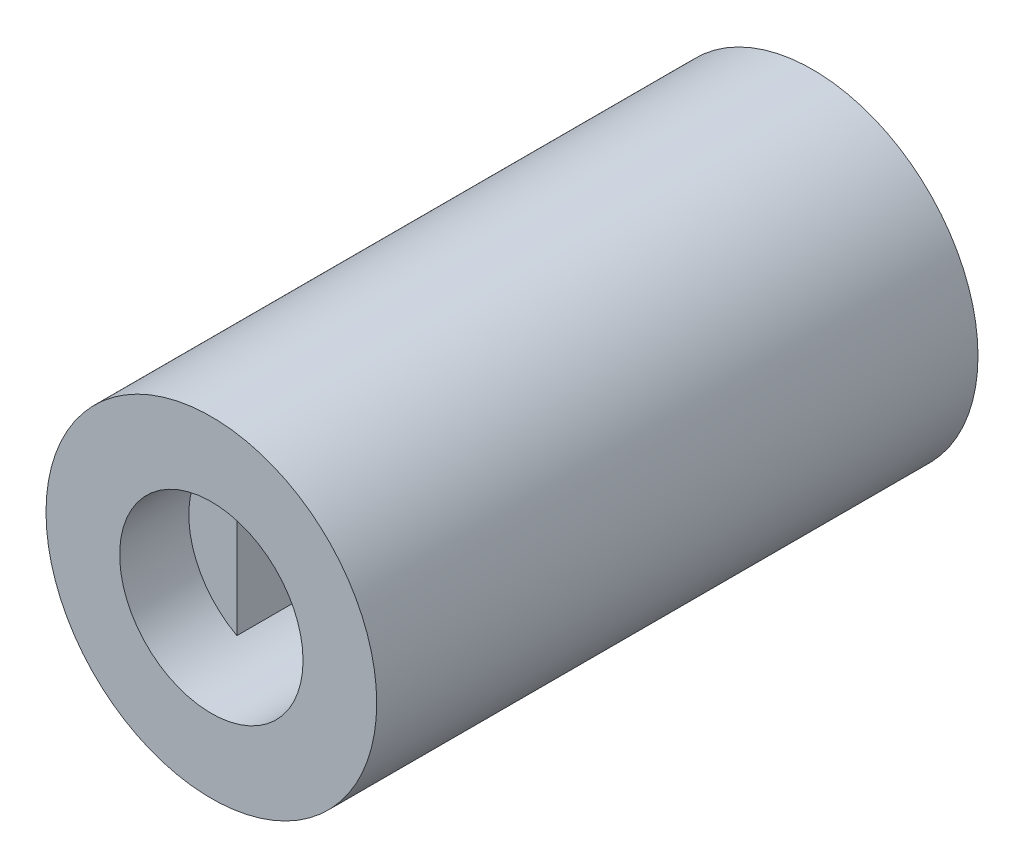
ISO-10303-21;
HEADER;
FILE_DESCRIPTION(('STEP AP214'),'2;1');
FILE_NAME('part.step','',(''),(''),'','','');
FILE_SCHEMA(('AUTOMOTIVE_DESIGN { 1 0 10303 214 1 1 1 1 }'));
ENDSEC;
DATA;
#1=APPLICATION_CONTEXT('core data for automotive mechanical design processes');
#2=APPLICATION_PROTOCOL_DEFINITION('international standard','automotive_design',2000,#1);
#3=PRODUCT_CONTEXT('',#1,'mechanical');
#4=PRODUCT('Part','Part','',(#3));
#5=PRODUCT_RELATED_PRODUCT_CATEGORY('part','',(#4));
#6=PRODUCT_DEFINITION_FORMATION('','',#4);
#7=PRODUCT_DEFINITION_CONTEXT('part definition',#1,'design');
#8=PRODUCT_DEFINITION('design','',#6,#7);
#9=PRODUCT_DEFINITION_SHAPE('','',#8);
#10=(LENGTH_UNIT() NAMED_UNIT(*) SI_UNIT(.MILLI.,.METRE.));
#11=(NAMED_UNIT(*) PLANE_ANGLE_UNIT() SI_UNIT($,.RADIAN.));
#12=(NAMED_UNIT(*) SI_UNIT($,.STERADIAN.) SOLID_ANGLE_UNIT());
#13=UNCERTAINTY_MEASURE_WITH_UNIT(LENGTH_MEASURE(1.E-05),#10,'distance_accuracy_value','');
#14=(GEOMETRIC_REPRESENTATION_CONTEXT(3) GLOBAL_UNCERTAINTY_ASSIGNED_CONTEXT((#13)) GLOBAL_UNIT_ASSIGNED_CONTEXT((#10,
#11,#12)) REPRESENTATION_CONTEXT('',''));
#15=CARTESIAN_POINT('',(0.,0.,0.));
#16=DIRECTION('',(0.,0.,1.));
#17=DIRECTION('',(1.,0.,0.));
#18=AXIS2_PLACEMENT_3D('',#15,#16,#17);
#19=CARTESIAN_POINT('',(-1.45,0.,8.));
#20=DIRECTION('',(1.,0.,0.));
#21=DIRECTION('',(0.,1.,0.));
#22=AXIS2_PLACEMENT_3D('',#19,#20,#21);
#23=PLANE('',#22);
#24=DIRECTION('',(0.,0.,1.));
#25=VECTOR('',#24,1.);
#26=CARTESIAN_POINT('',(-1.45,2.68328157299975,8.));
#27=LINE('',#26,#25);
#28=CARTESIAN_POINT('',(-1.45,2.68328157299975,8.));
#29=VERTEX_POINT('',#28);
#30=CARTESIAN_POINT('',(-1.45,2.68328157299975,17.7));
#31=VERTEX_POINT('',#30);
#32=EDGE_CURVE('E96',#29,#31,#27,.T.);
#33=ORIENTED_EDGE('',*,*,#32,.T.);
#34=DIRECTION('',(0.,-1.,0.));
#35=VECTOR('',#34,1.);
#36=CARTESIAN_POINT('',(-1.45,0.,17.7));
#37=LINE('',#36,#35);
#38=CARTESIAN_POINT('',(-1.45,-2.68328157299975,17.7));
#39=VERTEX_POINT('',#38);
#40=EDGE_CURVE('E86',#31,#39,#37,.T.);
#41=ORIENTED_EDGE('',*,*,#40,.T.);
#42=DIRECTION('',(0.,0.,1.));
#43=VECTOR('',#42,1.);
#44=CARTESIAN_POINT('',(-1.45,-2.68328157299975,8.));
#45=LINE('',#44,#43);
#46=CARTESIAN_POINT('',(-1.45,-2.68328157299975,8.));
#47=VERTEX_POINT('',#46);
#48=EDGE_CURVE('E98',#47,#39,#45,.T.);
#49=ORIENTED_EDGE('',*,*,#48,.F.);
#50=DIRECTION('',(0.,1.,0.));
#51=VECTOR('',#50,1.);
#52=CARTESIAN_POINT('',(-1.45,0.,8.));
#53=LINE('',#52,#51);
#54=EDGE_CURVE('E101',#47,#29,#53,.T.);
#55=ORIENTED_EDGE('',*,*,#54,.T.);
#56=EDGE_LOOP('',(#33,#41,#49,#55));
#57=FACE_BOUND('',#56,.T.);
#58=ADVANCED_FACE('F36',(#57),#23,.T.);
#59=CARTESIAN_POINT('',(0.,0.,0.));
#60=DIRECTION('',(0.,0.,1.));
#61=DIRECTION('',(1.,0.,0.));
#62=AXIS2_PLACEMENT_3D('',#59,#60,#61);
#63=PLANE('',#62);
#64=CARTESIAN_POINT('',(0.,0.,0.));
#65=DIRECTION('',(0.,0.,1.));
#66=DIRECTION('',(1.,0.,0.));
#67=AXIS2_PLACEMENT_3D('',#64,#65,#66);
#68=CIRCLE('',#67,5.5);
#69=CARTESIAN_POINT('',(5.5,0.,0.));
#70=VERTEX_POINT('',#69);
#71=EDGE_CURVE('E40',#70,#70,#68,.T.);
#72=ORIENTED_EDGE('',*,*,#71,.F.);
#73=EDGE_LOOP('',(#72));
#74=FACE_BOUND('',#73,.T.);
#75=DIRECTION('',(0.,-1.,0.));
#76=VECTOR('',#75,1.);
#77=CARTESIAN_POINT('',(-2.3,0.,0.));
#78=LINE('',#77,#76);
#79=CARTESIAN_POINT('',(-2.3,2.07846096908265,0.));
#80=VERTEX_POINT('',#79);
#81=CARTESIAN_POINT('',(-2.3,-2.07846096908265,0.));
#82=VERTEX_POINT('',#81);
#83=EDGE_CURVE('E58',#80,#82,#78,.T.);
#84=ORIENTED_EDGE('',*,*,#83,.T.);
#85=CARTESIAN_POINT('',(0.,0.,0.));
#86=DIRECTION('',(0.,0.,-1.));
#87=DIRECTION('',(-1.,0.,0.));
#88=AXIS2_PLACEMENT_3D('',#85,#86,#87);
#89=CIRCLE('',#88,3.1);
#90=CARTESIAN_POINT('',(2.3,-2.07846096908265,0.));
#91=VERTEX_POINT('',#90);
#92=EDGE_CURVE('E124',#91,#82,#89,.T.);
#93=ORIENTED_EDGE('',*,*,#92,.F.);
#94=DIRECTION('',(0.,-1.,0.));
#95=VECTOR('',#94,1.);
#96=CARTESIAN_POINT('',(2.3,0.,0.));
#97=LINE('',#96,#95);
#98=CARTESIAN_POINT('',(2.3,2.07846096908265,0.));
#99=VERTEX_POINT('',#98);
#100=EDGE_CURVE('E121',#99,#91,#97,.T.);
#101=ORIENTED_EDGE('',*,*,#100,.F.);
#102=EDGE_CURVE('E125',#80,#99,#89,.T.);
#103=ORIENTED_EDGE('',*,*,#102,.F.);
#104=EDGE_LOOP('',(#84,#93,#101,#103));
#105=FACE_BOUND('',#104,.T.);
#106=ADVANCED_FACE('F147',(#74,#105),#63,.F.);
#107=CARTESIAN_POINT('',(0.,0.,20.));
#108=DIRECTION('',(0.,0.,1.));
#109=DIRECTION('',(1.,0.,0.));
#110=AXIS2_PLACEMENT_3D('',#107,#108,#109);
#111=PLANE('',#110);
#112=CARTESIAN_POINT('',(0.,0.,20.));
#113=DIRECTION('',(0.,0.,1.));
#114=DIRECTION('',(1.,0.,0.));
#115=AXIS2_PLACEMENT_3D('',#112,#113,#114);
#116=CIRCLE('',#115,3.05);
#117=CARTESIAN_POINT('',(3.05,0.,20.));
#118=VERTEX_POINT('',#117);
#119=EDGE_CURVE('E107',#118,#118,#116,.T.);
#120=ORIENTED_EDGE('',*,*,#119,.F.);
#121=EDGE_LOOP('',(#120));
#122=FACE_BOUND('',#121,.T.);
#123=CARTESIAN_POINT('',(0.,0.,20.));
#124=DIRECTION('',(0.,0.,1.));
#125=DIRECTION('',(1.,0.,0.));
#126=AXIS2_PLACEMENT_3D('',#123,#124,#125);
#127=CIRCLE('',#126,5.5);
#128=CARTESIAN_POINT('',(5.5,0.,20.));
#129=VERTEX_POINT('',#128);
#130=EDGE_CURVE('E12',#129,#129,#127,.T.);
#131=ORIENTED_EDGE('',*,*,#130,.T.);
#132=EDGE_LOOP('',(#131));
#133=FACE_BOUND('',#132,.T.);
#134=ADVANCED_FACE('F170',(#122,#133),#111,.T.);
#135=CARTESIAN_POINT('',(0.,0.,20.));
#136=DIRECTION('',(0.,0.,-1.));
#137=DIRECTION('',(-1.,0.,0.));
#138=AXIS2_PLACEMENT_3D('',#135,#136,#137);
#139=CYLINDRICAL_SURFACE('',#138,5.5);
#140=ORIENTED_EDGE('',*,*,#130,.F.);
#141=EDGE_LOOP('',(#140));
#142=FACE_BOUND('',#141,.T.);
#143=ORIENTED_EDGE('',*,*,#71,.T.);
#144=EDGE_LOOP('',(#143));
#145=FACE_BOUND('',#144,.T.);
#146=ADVANCED_FACE('F38',(#142,#145),#139,.T.);
#147=CARTESIAN_POINT('',(0.,0.,8.));
#148=DIRECTION('',(0.,0.,1.));
#149=DIRECTION('',(1.,0.,0.));
#150=AXIS2_PLACEMENT_3D('',#147,#148,#149);
#151=CYLINDRICAL_SURFACE('',#150,3.05);
#152=ORIENTED_EDGE('',*,*,#119,.T.);
#153=EDGE_LOOP('',(#152));
#154=FACE_BOUND('',#153,.T.);
#155=CARTESIAN_POINT('',(0.,0.,17.7));
#156=DIRECTION('',(0.,0.,1.));
#157=DIRECTION('',(1.,0.,0.));
#158=AXIS2_PLACEMENT_3D('',#155,#156,#157);
#159=CIRCLE('',#158,3.05);
#160=EDGE_CURVE('E50',#31,#39,#159,.T.);
#161=ORIENTED_EDGE('',*,*,#160,.F.);
#162=ORIENTED_EDGE('',*,*,#32,.F.);
#163=CARTESIAN_POINT('',(0.,0.,8.));
#164=DIRECTION('',(0.,0.,1.));
#165=DIRECTION('',(1.,0.,0.));
#166=AXIS2_PLACEMENT_3D('',#163,#164,#165);
#167=CIRCLE('',#166,3.05);
#168=EDGE_CURVE('E104',#47,#29,#167,.T.);
#169=ORIENTED_EDGE('',*,*,#168,.F.);
#170=ORIENTED_EDGE('',*,*,#48,.T.);
#171=EDGE_LOOP('',(#161,#162,#169,#170));
#172=FACE_BOUND('',#171,.T.);
#173=ADVANCED_FACE('F94',(#154,#172),#151,.F.);
#174=CARTESIAN_POINT('',(0.,0.,8.));
#175=DIRECTION('',(0.,0.,1.));
#176=DIRECTION('',(1.,0.,0.));
#177=AXIS2_PLACEMENT_3D('',#174,#175,#176);
#178=PLANE('',#177);
#179=ORIENTED_EDGE('',*,*,#54,.F.);
#180=ORIENTED_EDGE('',*,*,#168,.T.);
#181=EDGE_LOOP('',(#179,#180));
#182=FACE_BOUND('',#181,.T.);
#183=ADVANCED_FACE('F188',(#182),#178,.T.);
#184=CARTESIAN_POINT('',(-2.3,0.,7.8));
#185=DIRECTION('',(1.,0.,0.));
#186=DIRECTION('',(0.,0.,-1.));
#187=AXIS2_PLACEMENT_3D('',#184,#185,#186);
#188=PLANE('',#187);
#189=ORIENTED_EDGE('',*,*,#83,.F.);
#190=DIRECTION('',(0.,0.,-1.));
#191=VECTOR('',#190,1.);
#192=CARTESIAN_POINT('',(-2.3,2.07846096908265,7.8));
#193=LINE('',#192,#191);
#194=CARTESIAN_POINT('',(-2.3,2.07846096908265,7.8));
#195=VERTEX_POINT('',#194);
#196=EDGE_CURVE('E113',#195,#80,#193,.T.);
#197=ORIENTED_EDGE('',*,*,#196,.F.);
#198=DIRECTION('',(0.,-1.,0.));
#199=VECTOR('',#198,1.);
#200=CARTESIAN_POINT('',(-2.3,0.,7.8));
#201=LINE('',#200,#199);
#202=CARTESIAN_POINT('',(-2.3,-2.07846096908265,7.8));
#203=VERTEX_POINT('',#202);
#204=EDGE_CURVE('E135',#195,#203,#201,.T.);
#205=ORIENTED_EDGE('',*,*,#204,.T.);
#206=DIRECTION('',(0.,0.,-1.));
#207=VECTOR('',#206,1.);
#208=CARTESIAN_POINT('',(-2.3,-2.07846096908265,7.8));
#209=LINE('',#208,#207);
#210=EDGE_CURVE('E110',#203,#82,#209,.T.);
#211=ORIENTED_EDGE('',*,*,#210,.T.);
#212=EDGE_LOOP('',(#189,#197,#205,#211));
#213=FACE_BOUND('',#212,.T.);
#214=ADVANCED_FACE('F152',(#213),#188,.T.);
#215=CARTESIAN_POINT('',(0.,0.,7.8));
#216=DIRECTION('',(0.,0.,-1.));
#217=DIRECTION('',(-1.,0.,0.));
#218=AXIS2_PLACEMENT_3D('',#215,#216,#217);
#219=CYLINDRICAL_SURFACE('',#218,3.1);
#220=ORIENTED_EDGE('',*,*,#92,.T.);
#221=ORIENTED_EDGE('',*,*,#210,.F.);
#222=CARTESIAN_POINT('',(0.,0.,7.8));
#223=DIRECTION('',(0.,0.,-1.));
#224=DIRECTION('',(-1.,0.,0.));
#225=AXIS2_PLACEMENT_3D('',#222,#223,#224);
#226=CIRCLE('',#225,3.1);
#227=CARTESIAN_POINT('',(2.3,-2.07846096908265,7.8));
#228=VERTEX_POINT('',#227);
#229=EDGE_CURVE('E116',#228,#203,#226,.T.);
#230=ORIENTED_EDGE('',*,*,#229,.F.);
#231=DIRECTION('',(0.,0.,-1.));
#232=VECTOR('',#231,1.);
#233=CARTESIAN_POINT('',(2.3,-2.07846096908265,7.8));
#234=LINE('',#233,#232);
#235=EDGE_CURVE('E118',#228,#91,#234,.T.);
#236=ORIENTED_EDGE('',*,*,#235,.T.);
#237=EDGE_LOOP('',(#220,#221,#230,#236));
#238=FACE_BOUND('',#237,.T.);
#239=ADVANCED_FACE('F141',(#238),#219,.F.);
#240=CARTESIAN_POINT('',(2.3,0.,7.8));
#241=DIRECTION('',(1.,0.,0.));
#242=DIRECTION('',(0.,0.,-1.));
#243=AXIS2_PLACEMENT_3D('',#240,#241,#242);
#244=PLANE('',#243);
#245=ORIENTED_EDGE('',*,*,#100,.T.);
#246=ORIENTED_EDGE('',*,*,#235,.F.);
#247=DIRECTION('',(0.,-1.,0.));
#248=VECTOR('',#247,1.);
#249=CARTESIAN_POINT('',(2.3,0.,7.8));
#250=LINE('',#249,#248);
#251=CARTESIAN_POINT('',(2.3,2.07846096908265,7.8));
#252=VERTEX_POINT('',#251);
#253=EDGE_CURVE('E129',#252,#228,#250,.T.);
#254=ORIENTED_EDGE('',*,*,#253,.F.);
#255=DIRECTION('',(0.,0.,-1.));
#256=VECTOR('',#255,1.);
#257=CARTESIAN_POINT('',(2.3,2.07846096908265,7.8));
#258=LINE('',#257,#256);
#259=EDGE_CURVE('E115',#252,#99,#258,.T.);
#260=ORIENTED_EDGE('',*,*,#259,.T.);
#261=EDGE_LOOP('',(#245,#246,#254,#260));
#262=FACE_BOUND('',#261,.T.);
#263=ADVANCED_FACE('F156',(#262),#244,.F.);
#264=ORIENTED_EDGE('',*,*,#102,.T.);
#265=ORIENTED_EDGE('',*,*,#259,.F.);
#266=EDGE_CURVE('E132',#195,#252,#226,.T.);
#267=ORIENTED_EDGE('',*,*,#266,.F.);
#268=ORIENTED_EDGE('',*,*,#196,.T.);
#269=EDGE_LOOP('',(#264,#265,#267,#268));
#270=FACE_BOUND('',#269,.T.);
#271=ADVANCED_FACE('F149',(#270),#219,.F.);
#272=CARTESIAN_POINT('',(0.,0.,7.8));
#273=DIRECTION('',(0.,0.,-1.));
#274=DIRECTION('',(-1.,0.,0.));
#275=AXIS2_PLACEMENT_3D('',#272,#273,#274);
#276=PLANE('',#275);
#277=ORIENTED_EDGE('',*,*,#204,.F.);
#278=ORIENTED_EDGE('',*,*,#266,.T.);
#279=ORIENTED_EDGE('',*,*,#253,.T.);
#280=ORIENTED_EDGE('',*,*,#229,.T.);
#281=EDGE_LOOP('',(#277,#278,#279,#280));
#282=FACE_BOUND('',#281,.T.);
#283=ADVANCED_FACE('F154',(#282),#276,.T.);
#284=CARTESIAN_POINT('',(0.,0.,17.7));
#285=DIRECTION('',(0.,0.,1.));
#286=DIRECTION('',(1.,0.,0.));
#287=AXIS2_PLACEMENT_3D('',#284,#285,#286);
#288=PLANE('',#287);
#289=ORIENTED_EDGE('',*,*,#160,.T.);
#290=ORIENTED_EDGE('',*,*,#40,.F.);
#291=EDGE_LOOP('',(#289,#290));
#292=FACE_BOUND('',#291,.T.);
#293=ADVANCED_FACE('F87',(#292),#288,.T.);
#294=CLOSED_SHELL('',(#58,#106,#134,#146,#173,#183,#214,#239,#263,#271,#283,#293));
#295=MANIFOLD_SOLID_BREP('B2',#294);
#296=ADVANCED_BREP_SHAPE_REPRESENTATION('',(#18,#295),#14);
#297=SHAPE_DEFINITION_REPRESENTATION(#9,#296);
ENDSEC;
END-ISO-10303-21;
